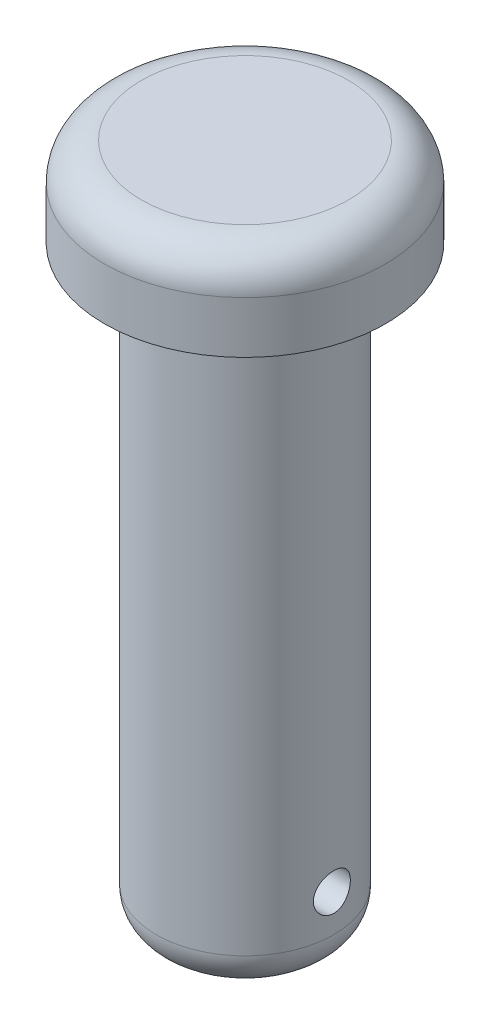
ISO-10303-21;
HEADER;
FILE_DESCRIPTION(('STEP AP214'),'2;1');
FILE_NAME('part.step','',(''),(''),'','','');
FILE_SCHEMA(('AUTOMOTIVE_DESIGN { 1 0 10303 214 1 1 1 1 }'));
ENDSEC;
DATA;
#1=APPLICATION_CONTEXT('core data for automotive mechanical design processes');
#2=APPLICATION_PROTOCOL_DEFINITION('international standard','automotive_design',2000,#1);
#3=PRODUCT_CONTEXT('',#1,'mechanical');
#4=PRODUCT('Part','Part','',(#3));
#5=PRODUCT_RELATED_PRODUCT_CATEGORY('part','',(#4));
#6=PRODUCT_DEFINITION_FORMATION('','',#4);
#7=PRODUCT_DEFINITION_CONTEXT('part definition',#1,'design');
#8=PRODUCT_DEFINITION('design','',#6,#7);
#9=PRODUCT_DEFINITION_SHAPE('','',#8);
#10=(LENGTH_UNIT() NAMED_UNIT(*) SI_UNIT(.MILLI.,.METRE.));
#11=(NAMED_UNIT(*) PLANE_ANGLE_UNIT() SI_UNIT($,.RADIAN.));
#12=(NAMED_UNIT(*) SI_UNIT($,.STERADIAN.) SOLID_ANGLE_UNIT());
#13=UNCERTAINTY_MEASURE_WITH_UNIT(LENGTH_MEASURE(1.E-05),#10,'distance_accuracy_value','');
#14=(GEOMETRIC_REPRESENTATION_CONTEXT(3) GLOBAL_UNCERTAINTY_ASSIGNED_CONTEXT((#13)) GLOBAL_UNIT_ASSIGNED_CONTEXT((#10,
#11,#12)) REPRESENTATION_CONTEXT('',''));
#15=CARTESIAN_POINT('',(0.,0.,0.));
#16=DIRECTION('',(0.,0.,1.));
#17=DIRECTION('',(1.,0.,0.));
#18=AXIS2_PLACEMENT_3D('',#15,#16,#17);
#19=CARTESIAN_POINT('',(0.,52.,0.));
#20=DIRECTION('',(0.,-1.,0.));
#21=DIRECTION('',(0.,0.,-1.));
#22=AXIS2_PLACEMENT_3D('',#19,#20,#21);
#23=PLANE('',#22);
#24=CARTESIAN_POINT('',(0.,52.,0.));
#25=DIRECTION('',(0.,1.,0.));
#26=DIRECTION('',(0.,0.,1.));
#27=AXIS2_PLACEMENT_3D('',#24,#25,#26);
#28=CIRCLE('',#27,14.);
#29=CARTESIAN_POINT('',(0.,52.,14.));
#30=VERTEX_POINT('',#29);
#31=EDGE_CURVE('E10',#30,#30,#28,.T.);
#32=ORIENTED_EDGE('',*,*,#31,.T.);
#33=EDGE_LOOP('',(#32));
#34=FACE_BOUND('',#33,.T.);
#35=ADVANCED_FACE('F32',(#34),#23,.F.);
#36=CARTESIAN_POINT('',(0.,47.,0.));
#37=DIRECTION('',(0.,1.,0.));
#38=DIRECTION('',(0.,0.,1.));
#39=AXIS2_PLACEMENT_3D('',#36,#37,#38);
#40=TOROIDAL_SURFACE('',#39,14.,5.);
#41=ORIENTED_EDGE('',*,*,#31,.F.);
#42=EDGE_LOOP('',(#41));
#43=FACE_BOUND('',#42,.T.);
#44=CARTESIAN_POINT('',(0.,47.,0.));
#45=DIRECTION('',(0.,1.,0.));
#46=DIRECTION('',(0.,0.,1.));
#47=AXIS2_PLACEMENT_3D('',#44,#45,#46);
#48=CIRCLE('',#47,19.);
#49=CARTESIAN_POINT('',(0.,47.,19.));
#50=VERTEX_POINT('',#49);
#51=EDGE_CURVE('E43',#50,#50,#48,.T.);
#52=ORIENTED_EDGE('',*,*,#51,.T.);
#53=EDGE_LOOP('',(#52));
#54=FACE_BOUND('',#53,.T.);
#55=ADVANCED_FACE('F79',(#43,#54),#40,.T.);
#56=CARTESIAN_POINT('',(0.,87.0769230769231,0.));
#57=DIRECTION('',(0.,1.,0.));
#58=DIRECTION('',(0.,0.,1.));
#59=AXIS2_PLACEMENT_3D('',#56,#57,#58);
#60=CYLINDRICAL_SURFACE('',#59,19.);
#61=ORIENTED_EDGE('',*,*,#51,.F.);
#62=EDGE_LOOP('',(#61));
#63=FACE_BOUND('',#62,.T.);
#64=CARTESIAN_POINT('',(0.,40.,0.));
#65=DIRECTION('',(0.,1.,0.));
#66=DIRECTION('',(0.,0.,1.));
#67=AXIS2_PLACEMENT_3D('',#64,#65,#66);
#68=CIRCLE('',#67,19.);
#69=CARTESIAN_POINT('',(0.,40.,19.));
#70=VERTEX_POINT('',#69);
#71=EDGE_CURVE('E48',#70,#70,#68,.T.);
#72=ORIENTED_EDGE('',*,*,#71,.T.);
#73=EDGE_LOOP('',(#72));
#74=FACE_BOUND('',#73,.T.);
#75=ADVANCED_FACE('F83',(#63,#74),#60,.T.);
#76=CARTESIAN_POINT('',(19.,40.,0.));
#77=DIRECTION('',(0.,1.,0.));
#78=DIRECTION('',(0.,0.,1.));
#79=AXIS2_PLACEMENT_3D('',#76,#77,#78);
#80=PLANE('',#79);
#81=ORIENTED_EDGE('',*,*,#71,.F.);
#82=EDGE_LOOP('',(#81));
#83=FACE_BOUND('',#82,.T.);
#84=CARTESIAN_POINT('',(0.,40.,0.));
#85=DIRECTION('',(0.,1.,0.));
#86=DIRECTION('',(0.,0.,1.));
#87=AXIS2_PLACEMENT_3D('',#84,#85,#86);
#88=CIRCLE('',#87,12.);
#89=CARTESIAN_POINT('',(0.,40.,12.));
#90=VERTEX_POINT('',#89);
#91=EDGE_CURVE('E100',#90,#90,#88,.T.);
#92=ORIENTED_EDGE('',*,*,#91,.T.);
#93=EDGE_LOOP('',(#92));
#94=FACE_BOUND('',#93,.T.);
#95=ADVANCED_FACE('F74',(#83,#94),#80,.F.);
#96=CARTESIAN_POINT('',(0.,87.0769230769231,0.));
#97=DIRECTION('',(0.,1.,0.));
#98=DIRECTION('',(0.,0.,1.));
#99=AXIS2_PLACEMENT_3D('',#96,#97,#98);
#100=CYLINDRICAL_SURFACE('',#99,12.);
#101=CARTESIAN_POINT('',(-11.7366945943055,-30.,-2.5));
#102=CARTESIAN_POINT('',(-11.7366973843002,-29.8612187696962,-2.49999501755299));
#103=CARTESIAN_POINT('',(-11.7391829184982,-29.7223760559691,-2.48840458867922));
#104=CARTESIAN_POINT('',(-11.7488403116286,-29.448627365366,-2.44239298467531));
#105=CARTESIAN_POINT('',(-11.7560157627658,-29.3137244889873,-2.40795430880677));
#106=CARTESIAN_POINT('',(-11.7742058592406,-29.0518552543301,-2.31736795014468));
#107=CARTESIAN_POINT('',(-11.7852165141394,-28.9248808080164,-2.26124282497867));
#108=CARTESIAN_POINT('',(-11.8098316267143,-28.6821510007088,-2.12893977203463));
#109=CARTESIAN_POINT('',(-11.8234359795523,-28.56639518654,-2.05276265471639));
#110=CARTESIAN_POINT('',(-11.8519386932295,-28.3476092496931,-1.88127279893217));
#111=CARTESIAN_POINT('',(-11.8668522874608,-28.2447762127471,-1.78571110973934));
#112=CARTESIAN_POINT('',(-11.8961593360515,-28.0564778627038,-1.57870244776128));
#113=CARTESIAN_POINT('',(-11.9105527521983,-27.9710138234171,-1.46725431091201));
#114=CARTESIAN_POINT('',(-11.937362702377,-27.8191082238343,-1.23032410599918));
#115=CARTESIAN_POINT('',(-11.9497591726248,-27.7528549470735,-1.10471885640988));
#116=CARTESIAN_POINT('',(-11.971006946866,-27.6424678942805,-0.843857102013441));
#117=CARTESIAN_POINT('',(-11.9798586112244,-27.5983318696929,-0.708601579901184));
#118=CARTESIAN_POINT('',(-11.9929117978436,-27.5340484777651,-0.434325808401006));
#119=CARTESIAN_POINT('',(-11.9971778391985,-27.5135679656097,-0.295386761832717));
#120=CARTESIAN_POINT('',(-12.0008022516122,-27.496136608486,-0.0159836976790504));
#121=CARTESIAN_POINT('',(-12.0001611340738,-27.4991833116138,0.124480159473675));
#122=CARTESIAN_POINT('',(-11.9940931618102,-27.5284692019135,0.400653172399142));
#123=CARTESIAN_POINT('',(-11.9887403791317,-27.5543494379162,0.536402257452949));
#124=CARTESIAN_POINT('',(-11.9739344179777,-27.6279972506626,0.801587492579503));
#125=CARTESIAN_POINT('',(-11.9644810658381,-27.6757657544062,0.931023375022043));
#126=CARTESIAN_POINT('',(-11.9424153464785,-27.792160104251,1.18092001076937));
#127=CARTESIAN_POINT('',(-11.9297820825069,-27.8609245884193,1.3013142699633));
#128=CARTESIAN_POINT('',(-11.9027460088038,-28.0172560056808,1.5289869130213));
#129=CARTESIAN_POINT('',(-11.8883429791665,-28.1048252764123,1.63626366363284));
#130=CARTESIAN_POINT('',(-11.8590340046655,-28.2982432497821,1.83678840655382));
#131=CARTESIAN_POINT('',(-11.8441236995185,-28.4044061199639,1.92973297498959));
#132=CARTESIAN_POINT('',(-11.8157374529799,-28.6309640979896,2.09655194480976));
#133=CARTESIAN_POINT('',(-11.8022615435432,-28.7513595227745,2.1704259213996));
#134=CARTESIAN_POINT('',(-11.7782599681831,-29.0034245096576,2.29712434276909));
#135=CARTESIAN_POINT('',(-11.7677417046425,-29.1351213013869,2.34989610979454));
#136=CARTESIAN_POINT('',(-11.7509521282072,-29.4057832387388,2.43247155077346));
#137=CARTESIAN_POINT('',(-11.7446802101436,-29.5447473456162,2.46227849764697));
#138=CARTESIAN_POINT('',(-11.7372156647826,-29.8232394126378,2.49761727734035));
#139=CARTESIAN_POINT('',(-11.7359310372695,-29.9627091690741,2.50358885835997));
#140=CARTESIAN_POINT('',(-11.7383390403741,-30.2406516230803,2.49227386878589));
#141=CARTESIAN_POINT('',(-11.7420313630525,-30.3791243818047,2.47498873715726));
#142=CARTESIAN_POINT('',(-11.7538907645233,-30.6496410321163,2.41803116650968));
#143=CARTESIAN_POINT('',(-11.7620102256599,-30.7817373343577,2.37859682753743));
#144=CARTESIAN_POINT('',(-11.7817667700624,-31.0374479788832,2.27871621721839));
#145=CARTESIAN_POINT('',(-11.7934041638211,-31.1610615713008,2.21826809112293));
#146=CARTESIAN_POINT('',(-11.8190900387438,-31.3982128824325,2.0770919636297));
#147=CARTESIAN_POINT('',(-11.8331701329665,-31.5115844089323,1.99609065470793));
#148=CARTESIAN_POINT('',(-11.8620696798781,-31.7232864983101,1.81646888113976));
#149=CARTESIAN_POINT('',(-11.8768892153306,-31.8216153724785,1.71784644101035));
#150=CARTESIAN_POINT('',(-11.9058984863347,-32.0021254261943,1.50380090168669));
#151=CARTESIAN_POINT('',(-11.9200734943982,-32.0840081900528,1.38812381522911));
#152=CARTESIAN_POINT('',(-11.9459341754481,-32.227177504176,1.14440020443273));
#153=CARTESIAN_POINT('',(-11.9576199584164,-32.2884649644749,1.01635422695377));
#154=CARTESIAN_POINT('',(-11.9771229654136,-32.3882773586347,0.752284235695844));
#155=CARTESIAN_POINT('',(-11.9849632627299,-32.4269383310887,0.616313421940397));
#156=CARTESIAN_POINT('',(-11.9959912282046,-32.4808288080162,0.339626801006947));
#157=CARTESIAN_POINT('',(-11.9991795068579,-32.4960613870655,0.198911618923387));
#158=CARTESIAN_POINT('',(-12.0005281611387,-32.502535244097,-0.08042668694067));
#159=CARTESIAN_POINT('',(-11.9987822750957,-32.4942237999895,-0.219039184355819));
#160=CARTESIAN_POINT('',(-11.99065748189,-32.4548387226941,-0.492845740747124));
#161=CARTESIAN_POINT('',(-11.9842786434588,-32.4237654271863,-0.628039850405487));
#162=CARTESIAN_POINT('',(-11.9676092015489,-32.339944410703,-0.890863930984019));
#163=CARTESIAN_POINT('',(-11.9573290681437,-32.2872546722944,-1.01851310000873));
#164=CARTESIAN_POINT('',(-11.9339599069615,-32.1617552045355,-1.26322113444179));
#165=CARTESIAN_POINT('',(-11.9208706346327,-32.0889437233117,-1.38027907656019));
#166=CARTESIAN_POINT('',(-11.8930319356995,-31.9237806640155,-1.60268064259533));
#167=CARTESIAN_POINT('',(-11.8782576059507,-31.8311114238945,-1.70778526722739));
#168=CARTESIAN_POINT('',(-11.8488557363333,-31.6295109979979,-1.90110548396524));
#169=CARTESIAN_POINT('',(-11.8342282323044,-31.5205759400736,-1.98931704315914));
#170=CARTESIAN_POINT('',(-11.8065838324643,-31.287981795159,-2.14734903704121));
#171=CARTESIAN_POINT('',(-11.7935881325424,-31.1641631771794,-2.21693856248135));
#172=CARTESIAN_POINT('',(-11.7709407916825,-30.9063496879379,-2.3342125584477));
#173=CARTESIAN_POINT('',(-11.7612862067076,-30.7723639031215,-2.381916325835));
#174=CARTESIAN_POINT('',(-11.748280088364,-30.5317874368468,-2.44513108264677));
#175=CARTESIAN_POINT('',(-11.7439632719021,-30.4265409268095,-2.46566898011599));
#176=CARTESIAN_POINT('',(-11.7381695052653,-30.2142084389624,-2.4931050871655));
#177=CARTESIAN_POINT('',(-11.7366924407628,-30.1071225353812,-2.50000384585404));
#178=CARTESIAN_POINT('',(-11.7366945943055,-30.,-2.5));
#179=B_SPLINE_CURVE_WITH_KNOTS('',3,(#101,#102,#103,#104,#105,#106,#107,#108,#109,#110,#111,
#112,#113,#114,#115,#116,#117,#118,#119,#120,#121,#122,#123,#124,#125,#126,#127,#128,#129,#130,
#131,#132,#133,#134,#135,#136,#137,#138,#139,#140,#141,#142,#143,#144,#145,#146,#147,#148,#149,
#150,#151,#152,#153,#154,#155,#156,#157,#158,#159,#160,#161,#162,#163,#164,#165,#166,#167,#168,
#169,#170,#171,#172,#173,#174,#175,#176,#177,#178),.UNSPECIFIED.,.T.,.F.,(4,2,2,2,2,2,2,2,2,2,2,
2,2,2,2,2,2,2,2,2,2,2,2,2,2,2,2,2,2,2,2,2,2,2,2,2,2,2,4),(0.,0.415951308142539,0.83222158483494,
1.24806002960546,1.66388166963158,2.08542666935769,2.50700257327747,2.93258052533688,
3.35811520213866,3.77758097718529,4.19700303792677,4.60994682832922,5.02290810911741,
5.43865743955899,5.8544584820852,6.27811724489827,6.70178544383256,7.12650474664976,
7.55116350775195,7.96795032019585,8.38471134593048,8.79707572463846,9.20947650928062,
9.62767835869302,10.0459271216437,10.4711891750669,10.8964324351808,11.3190919929707,
11.7416960791916,12.1563258784529,12.5709495266596,12.984468211702,13.3980229105635,
13.8187663795715,14.2396101685507,14.6654530271772,15.0909196914727,15.4119973517483,
15.7330620852562),.UNSPECIFIED.);
#180=CARTESIAN_POINT('',(-11.7366945943055,-30.,-2.5));
#181=VERTEX_POINT('',#180);
#182=EDGE_CURVE('E35',#181,#181,#179,.T.);
#183=ORIENTED_EDGE('',*,*,#182,.T.);
#184=EDGE_LOOP('',(#183));
#185=FACE_BOUND('',#184,.T.);
#186=CARTESIAN_POINT('',(11.7366945943055,-30.,-2.5));
#187=CARTESIAN_POINT('',(11.7366973843002,-30.1387812303038,-2.49999501755299));
#188=CARTESIAN_POINT('',(11.7391829184982,-30.2776239440309,-2.48840458867922));
#189=CARTESIAN_POINT('',(11.7488403116286,-30.551372634634,-2.44239298467531));
#190=CARTESIAN_POINT('',(11.7560157627658,-30.6862755110127,-2.40795430880677));
#191=CARTESIAN_POINT('',(11.7742058592406,-30.9481447456699,-2.31736795014468));
#192=CARTESIAN_POINT('',(11.7852165141394,-31.0751191919836,-2.26124282497867));
#193=CARTESIAN_POINT('',(11.8098316267143,-31.3178489992912,-2.12893977203463));
#194=CARTESIAN_POINT('',(11.8234359795523,-31.43360481346,-2.05276265471639));
#195=CARTESIAN_POINT('',(11.8519386932295,-31.6523907503069,-1.88127279893217));
#196=CARTESIAN_POINT('',(11.8668522874608,-31.7552237872529,-1.78571110973934));
#197=CARTESIAN_POINT('',(11.8961593360515,-31.9435221372962,-1.57870244776128));
#198=CARTESIAN_POINT('',(11.9105527521983,-32.0289861765829,-1.46725431091201));
#199=CARTESIAN_POINT('',(11.937362702377,-32.1808917761657,-1.23032410599918));
#200=CARTESIAN_POINT('',(11.9497591726248,-32.2471450529265,-1.10471885640989));
#201=CARTESIAN_POINT('',(11.971006946866,-32.3575321057196,-0.843857102013446));
#202=CARTESIAN_POINT('',(11.9798586112244,-32.4016681303071,-0.708601579901187));
#203=CARTESIAN_POINT('',(11.9929117978436,-32.465951522235,-0.434325808401008));
#204=CARTESIAN_POINT('',(11.9971778391985,-32.4864320343903,-0.295386761832718));
#205=CARTESIAN_POINT('',(12.0008022516122,-32.503863391514,-0.0159836976790508));
#206=CARTESIAN_POINT('',(12.0001611340738,-32.5008166883862,0.124480159473675));
#207=CARTESIAN_POINT('',(11.9940931618102,-32.4715307980865,0.400653172399142));
#208=CARTESIAN_POINT('',(11.9887403791317,-32.4456505620838,0.53640225745295));
#209=CARTESIAN_POINT('',(11.9739344179777,-32.3720027493374,0.801587492579504));
#210=CARTESIAN_POINT('',(11.9644810658381,-32.3242342455938,0.931023375022043));
#211=CARTESIAN_POINT('',(11.9424153464785,-32.207839895749,1.18092001076937));
#212=CARTESIAN_POINT('',(11.9297820825069,-32.1390754115807,1.3013142699633));
#213=CARTESIAN_POINT('',(11.9027460088038,-31.9827439943192,1.52898691302129));
#214=CARTESIAN_POINT('',(11.8883429791665,-31.8951747235878,1.63626366363284));
#215=CARTESIAN_POINT('',(11.8590340046655,-31.7017567502179,1.83678840655382));
#216=CARTESIAN_POINT('',(11.8441236995185,-31.5955938800361,1.92973297498959));
#217=CARTESIAN_POINT('',(11.8157374529799,-31.3690359020104,2.09655194480976));
#218=CARTESIAN_POINT('',(11.8022615435432,-31.2486404772255,2.1704259213996));
#219=CARTESIAN_POINT('',(11.7782599681831,-30.9965754903424,2.29712434276908));
#220=CARTESIAN_POINT('',(11.7677417046425,-30.8648786986131,2.34989610979454));
#221=CARTESIAN_POINT('',(11.7509521282072,-30.5942167612612,2.43247155077345));
#222=CARTESIAN_POINT('',(11.7446802101436,-30.4552526543838,2.46227849764697));
#223=CARTESIAN_POINT('',(11.7372156647826,-30.1767605873622,2.49761727734035));
#224=CARTESIAN_POINT('',(11.7359310372695,-30.037290830926,2.50358885835997));
#225=CARTESIAN_POINT('',(11.7383390403741,-29.7593483769197,2.49227386878589));
#226=CARTESIAN_POINT('',(11.7420313630525,-29.6208756181953,2.47498873715726));
#227=CARTESIAN_POINT('',(11.7538907645233,-29.3503589678838,2.41803116650968));
#228=CARTESIAN_POINT('',(11.7620102256599,-29.2182626656424,2.37859682753743));
#229=CARTESIAN_POINT('',(11.7817667700624,-28.9625520211168,2.27871621721839));
#230=CARTESIAN_POINT('',(11.7934041638211,-28.8389384286992,2.21826809112293));
#231=CARTESIAN_POINT('',(11.8190900387438,-28.6017871175676,2.07709196362969));
#232=CARTESIAN_POINT('',(11.8331701329665,-28.4884155910677,1.99609065470793));
#233=CARTESIAN_POINT('',(11.8620696798781,-28.2767135016899,1.81646888113976));
#234=CARTESIAN_POINT('',(11.8768892153306,-28.1783846275215,1.71784644101035));
#235=CARTESIAN_POINT('',(11.9058984863347,-27.9978745738057,1.50380090168668));
#236=CARTESIAN_POINT('',(11.9200734943982,-27.9159918099472,1.38812381522911));
#237=CARTESIAN_POINT('',(11.9459341754481,-27.772822495824,1.14440020443272));
#238=CARTESIAN_POINT('',(11.9576199584164,-27.7115350355251,1.01635422695376));
#239=CARTESIAN_POINT('',(11.9771229654136,-27.6117226413653,0.752284235695841));
#240=CARTESIAN_POINT('',(11.9849632627299,-27.5730616689113,0.616313421940394));
#241=CARTESIAN_POINT('',(11.9959912282046,-27.5191711919838,0.339626801006946));
#242=CARTESIAN_POINT('',(11.9991795068579,-27.5039386129345,0.198911618923388));
#243=CARTESIAN_POINT('',(12.0005281611387,-27.497464755903,-0.0804266869406687));
#244=CARTESIAN_POINT('',(11.9987822750957,-27.5057762000105,-0.219039184355818));
#245=CARTESIAN_POINT('',(11.99065748189,-27.5451612773059,-0.492845740747124));
#246=CARTESIAN_POINT('',(11.9842786434588,-27.5762345728137,-0.628039850405486));
#247=CARTESIAN_POINT('',(11.9676092015489,-27.660055589297,-0.890863930984018));
#248=CARTESIAN_POINT('',(11.9573290681437,-27.7127453277057,-1.01851310000873));
#249=CARTESIAN_POINT('',(11.9339599069615,-27.8382447954646,-1.26322113444179));
#250=CARTESIAN_POINT('',(11.9208706346327,-27.9110562766883,-1.38027907656019));
#251=CARTESIAN_POINT('',(11.8930319356995,-28.0762193359845,-1.60268064259533));
#252=CARTESIAN_POINT('',(11.8782576059507,-28.1688885761055,-1.70778526722739));
#253=CARTESIAN_POINT('',(11.8488557363333,-28.3704890020021,-1.90110548396523));
#254=CARTESIAN_POINT('',(11.8342282323044,-28.4794240599264,-1.98931704315914));
#255=CARTESIAN_POINT('',(11.8065838324643,-28.712018204841,-2.14734903704121));
#256=CARTESIAN_POINT('',(11.7935881325424,-28.8358368228206,-2.21693856248135));
#257=CARTESIAN_POINT('',(11.7709407916825,-29.0936503120621,-2.3342125584477));
#258=CARTESIAN_POINT('',(11.7612862067076,-29.2276360968785,-2.381916325835));
#259=CARTESIAN_POINT('',(11.748280088364,-29.4682125631532,-2.44513108264677));
#260=CARTESIAN_POINT('',(11.7439632719021,-29.5734590731905,-2.46566898011599));
#261=CARTESIAN_POINT('',(11.7381695052653,-29.7857915610376,-2.4931050871655));
#262=CARTESIAN_POINT('',(11.7366924407628,-29.8928774646188,-2.50000384585404));
#263=CARTESIAN_POINT('',(11.7366945943055,-30.,-2.5));
#264=B_SPLINE_CURVE_WITH_KNOTS('',3,(#186,#187,#188,#189,#190,#191,#192,#193,#194,#195,#196,
#197,#198,#199,#200,#201,#202,#203,#204,#205,#206,#207,#208,#209,#210,#211,#212,#213,#214,#215,
#216,#217,#218,#219,#220,#221,#222,#223,#224,#225,#226,#227,#228,#229,#230,#231,#232,#233,#234,
#235,#236,#237,#238,#239,#240,#241,#242,#243,#244,#245,#246,#247,#248,#249,#250,#251,#252,#253,
#254,#255,#256,#257,#258,#259,#260,#261,#262,#263),.UNSPECIFIED.,.T.,.F.,(4,2,2,2,2,2,2,2,2,2,2,
2,2,2,2,2,2,2,2,2,2,2,2,2,2,2,2,2,2,2,2,2,2,2,2,2,2,2,4),(0.,0.415951308142539,0.83222158483494,
1.24806002960545,1.66388166963159,2.08542666935769,2.50700257327747,2.93258052533687,
3.35811520213866,3.77758097718529,4.19700303792677,4.60994682832922,5.02290810911741,
5.43865743955899,5.85445848208519,6.27811724489827,6.70178544383256,7.12650474664976,
7.55116350775194,7.96795032019583,8.38471134593048,8.79707572463845,9.20947650928062,
9.62767835869302,10.0459271216437,10.4711891750669,10.8964324351808,11.3190919929707,
11.7416960791916,12.1563258784529,12.5709495266596,12.984468211702,13.3980229105635,
13.8187663795715,14.2396101685507,14.6654530271771,15.0909196914727,15.4119973517483,
15.7330620852562),.UNSPECIFIED.);
#265=CARTESIAN_POINT('',(11.7366945943055,-30.,-2.5));
#266=VERTEX_POINT('',#265);
#267=EDGE_CURVE('E51',#266,#266,#264,.T.);
#268=ORIENTED_EDGE('',*,*,#267,.T.);
#269=EDGE_LOOP('',(#268));
#270=FACE_BOUND('',#269,.T.);
#271=ORIENTED_EDGE('',*,*,#91,.F.);
#272=EDGE_LOOP('',(#271));
#273=FACE_BOUND('',#272,.T.);
#274=CARTESIAN_POINT('',(0.,-35.,0.));
#275=DIRECTION('',(0.,1.,0.));
#276=DIRECTION('',(0.,0.,1.));
#277=AXIS2_PLACEMENT_3D('',#274,#275,#276);
#278=CIRCLE('',#277,12.);
#279=CARTESIAN_POINT('',(0.,-35.,12.));
#280=VERTEX_POINT('',#279);
#281=EDGE_CURVE('E102',#280,#280,#278,.T.);
#282=ORIENTED_EDGE('',*,*,#281,.T.);
#283=EDGE_LOOP('',(#282));
#284=FACE_BOUND('',#283,.T.);
#285=ADVANCED_FACE('F55',(#185,#270,#273,#284),#100,.T.);
#286=CARTESIAN_POINT('',(0.,-35.,0.));
#287=DIRECTION('',(0.,1.,0.));
#288=DIRECTION('',(0.,0.,1.));
#289=AXIS2_PLACEMENT_3D('',#286,#287,#288);
#290=TOROIDAL_SURFACE('',#289,7.,5.);
#291=ORIENTED_EDGE('',*,*,#281,.F.);
#292=EDGE_LOOP('',(#291));
#293=FACE_BOUND('',#292,.T.);
#294=CARTESIAN_POINT('',(0.,-40.,0.));
#295=DIRECTION('',(0.,1.,0.));
#296=DIRECTION('',(0.,0.,1.));
#297=AXIS2_PLACEMENT_3D('',#294,#295,#296);
#298=CIRCLE('',#297,7.);
#299=CARTESIAN_POINT('',(0.,-40.,7.));
#300=VERTEX_POINT('',#299);
#301=EDGE_CURVE('E105',#300,#300,#298,.T.);
#302=ORIENTED_EDGE('',*,*,#301,.T.);
#303=EDGE_LOOP('',(#302));
#304=FACE_BOUND('',#303,.T.);
#305=ADVANCED_FACE('F67',(#293,#304),#290,.T.);
#306=CARTESIAN_POINT('',(7.,-40.,0.));
#307=DIRECTION('',(0.,1.,0.));
#308=DIRECTION('',(0.,0.,1.));
#309=AXIS2_PLACEMENT_3D('',#306,#307,#308);
#310=PLANE('',#309);
#311=ORIENTED_EDGE('',*,*,#301,.F.);
#312=EDGE_LOOP('',(#311));
#313=FACE_BOUND('',#312,.T.);
#314=ADVANCED_FACE('F63',(#313),#310,.F.);
#315=CARTESIAN_POINT('',(-35.,-30.,0.));
#316=DIRECTION('',(1.,0.,0.));
#317=DIRECTION('',(0.,0.,-1.));
#318=AXIS2_PLACEMENT_3D('',#315,#316,#317);
#319=CYLINDRICAL_SURFACE('',#318,2.5);
#320=ORIENTED_EDGE('',*,*,#267,.F.);
#321=EDGE_LOOP('',(#320));
#322=FACE_BOUND('',#321,.T.);
#323=ORIENTED_EDGE('',*,*,#182,.F.);
#324=EDGE_LOOP('',(#323));
#325=FACE_BOUND('',#324,.T.);
#326=ADVANCED_FACE('F59',(#322,#325),#319,.F.);
#327=CLOSED_SHELL('',(#35,#55,#75,#95,#285,#305,#314,#326));
#328=MANIFOLD_SOLID_BREP('B2',#327);
#329=ADVANCED_BREP_SHAPE_REPRESENTATION('',(#18,#328),#14);
#330=SHAPE_DEFINITION_REPRESENTATION(#9,#329);
ENDSEC;
END-ISO-10303-21;
